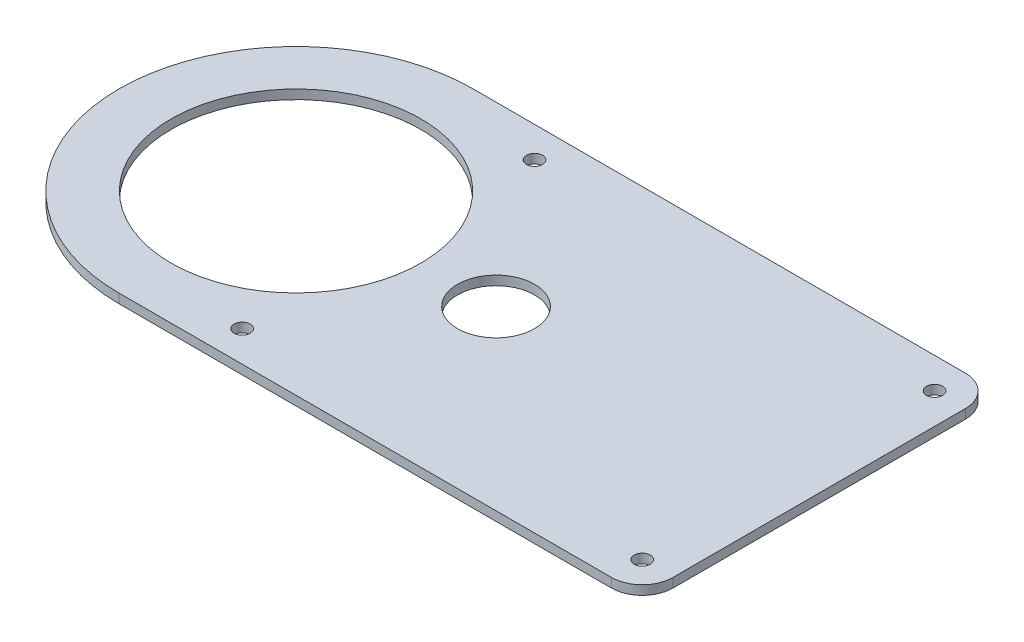
ISO-10303-21;
HEADER;
FILE_DESCRIPTION(('STEP AP214'),'2;1');
FILE_NAME('part.step','',(''),(''),'','','');
FILE_SCHEMA(('AUTOMOTIVE_DESIGN { 1 0 10303 214 1 1 1 1 }'));
ENDSEC;
DATA;
#1=APPLICATION_CONTEXT('core data for automotive mechanical design processes');
#2=APPLICATION_PROTOCOL_DEFINITION('international standard','automotive_design',2000,#1);
#3=PRODUCT_CONTEXT('',#1,'mechanical');
#4=PRODUCT('Part','Part','',(#3));
#5=PRODUCT_RELATED_PRODUCT_CATEGORY('part','',(#4));
#6=PRODUCT_DEFINITION_FORMATION('','',#4);
#7=PRODUCT_DEFINITION_CONTEXT('part definition',#1,'design');
#8=PRODUCT_DEFINITION('design','',#6,#7);
#9=PRODUCT_DEFINITION_SHAPE('','',#8);
#10=(LENGTH_UNIT() NAMED_UNIT(*) SI_UNIT(.MILLI.,.METRE.));
#11=(NAMED_UNIT(*) PLANE_ANGLE_UNIT() SI_UNIT($,.RADIAN.));
#12=(NAMED_UNIT(*) SI_UNIT($,.STERADIAN.) SOLID_ANGLE_UNIT());
#13=UNCERTAINTY_MEASURE_WITH_UNIT(LENGTH_MEASURE(1.E-05),#10,'distance_accuracy_value','');
#14=(GEOMETRIC_REPRESENTATION_CONTEXT(3) GLOBAL_UNCERTAINTY_ASSIGNED_CONTEXT((#13)) GLOBAL_UNIT_ASSIGNED_CONTEXT((#10,
#11,#12)) REPRESENTATION_CONTEXT('',''));
#15=CARTESIAN_POINT('',(0.,0.,0.));
#16=DIRECTION('',(0.,0.,1.));
#17=DIRECTION('',(1.,0.,0.));
#18=AXIS2_PLACEMENT_3D('',#15,#16,#17);
#19=CARTESIAN_POINT('',(0.,3.,-57.5));
#20=DIRECTION('',(0.,0.,-1.));
#21=DIRECTION('',(-1.,0.,0.));
#22=AXIS2_PLACEMENT_3D('',#19,#20,#21);
#23=PLANE('',#22);
#24=DIRECTION('',(1.,0.,0.));
#25=VECTOR('',#24,1.);
#26=CARTESIAN_POINT('',(0.,3.,-57.5));
#27=LINE('',#26,#25);
#28=CARTESIAN_POINT('',(0.,3.,-57.5));
#29=VERTEX_POINT('',#28);
#30=CARTESIAN_POINT('',(160.,3.,-57.5));
#31=VERTEX_POINT('',#30);
#32=EDGE_CURVE('E92',#29,#31,#27,.T.);
#33=ORIENTED_EDGE('',*,*,#32,.T.);
#34=DIRECTION('',(0.,-1.,0.));
#35=VECTOR('',#34,1.);
#36=CARTESIAN_POINT('',(160.,3.,-57.5));
#37=LINE('',#36,#35);
#38=CARTESIAN_POINT('',(160.,0.,-57.5));
#39=VERTEX_POINT('',#38);
#40=EDGE_CURVE('E99',#31,#39,#37,.T.);
#41=ORIENTED_EDGE('',*,*,#40,.T.);
#42=DIRECTION('',(1.,0.,0.));
#43=VECTOR('',#42,1.);
#44=CARTESIAN_POINT('',(0.,0.,-57.5));
#45=LINE('',#44,#43);
#46=CARTESIAN_POINT('',(0.,0.,-57.5));
#47=VERTEX_POINT('',#46);
#48=EDGE_CURVE('E95',#47,#39,#45,.T.);
#49=ORIENTED_EDGE('',*,*,#48,.F.);
#50=DIRECTION('',(0.,-1.,0.));
#51=VECTOR('',#50,1.);
#52=CARTESIAN_POINT('',(0.,3.,-57.5));
#53=LINE('',#52,#51);
#54=EDGE_CURVE('E88',#29,#47,#53,.T.);
#55=ORIENTED_EDGE('',*,*,#54,.F.);
#56=EDGE_LOOP('',(#33,#41,#49,#55));
#57=FACE_BOUND('',#56,.T.);
#58=ADVANCED_FACE('F35',(#57),#23,.T.);
#59=CARTESIAN_POINT('',(0.,3.,0.));
#60=DIRECTION('',(0.,-1.,0.));
#61=DIRECTION('',(0.,0.,-1.));
#62=AXIS2_PLACEMENT_3D('',#59,#60,#61);
#63=CYLINDRICAL_SURFACE('',#62,57.5);
#64=CARTESIAN_POINT('',(0.,0.,0.));
#65=DIRECTION('',(0.,1.,0.));
#66=DIRECTION('',(0.,0.,1.));
#67=AXIS2_PLACEMENT_3D('',#64,#65,#66);
#68=CIRCLE('',#67,57.5);
#69=CARTESIAN_POINT('',(0.,0.,57.5));
#70=VERTEX_POINT('',#69);
#71=EDGE_CURVE('E128',#47,#70,#68,.T.);
#72=ORIENTED_EDGE('',*,*,#71,.T.);
#73=DIRECTION('',(0.,-1.,0.));
#74=VECTOR('',#73,1.);
#75=CARTESIAN_POINT('',(0.,3.,57.5));
#76=LINE('',#75,#74);
#77=CARTESIAN_POINT('',(0.,3.,57.5));
#78=VERTEX_POINT('',#77);
#79=EDGE_CURVE('E100',#78,#70,#76,.T.);
#80=ORIENTED_EDGE('',*,*,#79,.F.);
#81=CARTESIAN_POINT('',(0.,3.,0.));
#82=DIRECTION('',(0.,1.,0.));
#83=DIRECTION('',(0.,0.,1.));
#84=AXIS2_PLACEMENT_3D('',#81,#82,#83);
#85=CIRCLE('',#84,57.5);
#86=EDGE_CURVE('E104',#29,#78,#85,.T.);
#87=ORIENTED_EDGE('',*,*,#86,.F.);
#88=ORIENTED_EDGE('',*,*,#54,.T.);
#89=EDGE_LOOP('',(#72,#80,#87,#88));
#90=FACE_BOUND('',#89,.T.);
#91=ADVANCED_FACE('F105',(#90),#63,.T.);
#92=CARTESIAN_POINT('',(0.,3.,57.5));
#93=DIRECTION('',(0.,0.,1.));
#94=DIRECTION('',(1.,0.,0.));
#95=AXIS2_PLACEMENT_3D('',#92,#93,#94);
#96=PLANE('',#95);
#97=DIRECTION('',(-1.,0.,0.));
#98=VECTOR('',#97,1.);
#99=CARTESIAN_POINT('',(0.,0.,57.5));
#100=LINE('',#99,#98);
#101=CARTESIAN_POINT('',(160.,0.,57.5));
#102=VERTEX_POINT('',#101);
#103=EDGE_CURVE('E131',#102,#70,#100,.T.);
#104=ORIENTED_EDGE('',*,*,#103,.F.);
#105=DIRECTION('',(0.,-1.,0.));
#106=VECTOR('',#105,1.);
#107=CARTESIAN_POINT('',(160.,3.,57.5));
#108=LINE('',#107,#106);
#109=CARTESIAN_POINT('',(160.,3.,57.5));
#110=VERTEX_POINT('',#109);
#111=EDGE_CURVE('E11',#102,#110,#108,.F.);
#112=ORIENTED_EDGE('',*,*,#111,.T.);
#113=DIRECTION('',(-1.,0.,0.));
#114=VECTOR('',#113,1.);
#115=CARTESIAN_POINT('',(0.,3.,57.5));
#116=LINE('',#115,#114);
#117=EDGE_CURVE('E107',#110,#78,#116,.T.);
#118=ORIENTED_EDGE('',*,*,#117,.T.);
#119=ORIENTED_EDGE('',*,*,#79,.T.);
#120=EDGE_LOOP('',(#104,#112,#118,#119));
#121=FACE_BOUND('',#120,.T.);
#122=ADVANCED_FACE('F156',(#121),#96,.T.);
#123=CARTESIAN_POINT('',(170.,3.,0.));
#124=DIRECTION('',(1.,0.,0.));
#125=DIRECTION('',(0.,0.,-1.));
#126=AXIS2_PLACEMENT_3D('',#123,#124,#125);
#127=PLANE('',#126);
#128=DIRECTION('',(0.,0.,1.));
#129=VECTOR('',#128,1.);
#130=CARTESIAN_POINT('',(170.,0.,0.));
#131=LINE('',#130,#129);
#132=CARTESIAN_POINT('',(170.,0.,-47.5));
#133=VERTEX_POINT('',#132);
#134=CARTESIAN_POINT('',(170.,0.,47.5));
#135=VERTEX_POINT('',#134);
#136=EDGE_CURVE('E115',#133,#135,#131,.T.);
#137=ORIENTED_EDGE('',*,*,#136,.F.);
#138=DIRECTION('',(0.,-1.,0.));
#139=VECTOR('',#138,1.);
#140=CARTESIAN_POINT('',(170.,3.,-47.5));
#141=LINE('',#140,#139);
#142=CARTESIAN_POINT('',(170.,3.,-47.5));
#143=VERTEX_POINT('',#142);
#144=EDGE_CURVE('E144',#133,#143,#141,.F.);
#145=ORIENTED_EDGE('',*,*,#144,.T.);
#146=DIRECTION('',(0.,0.,1.));
#147=VECTOR('',#146,1.);
#148=CARTESIAN_POINT('',(170.,3.,0.));
#149=LINE('',#148,#147);
#150=CARTESIAN_POINT('',(170.,3.,47.5));
#151=VERTEX_POINT('',#150);
#152=EDGE_CURVE('E122',#143,#151,#149,.T.);
#153=ORIENTED_EDGE('',*,*,#152,.T.);
#154=DIRECTION('',(0.,-1.,0.));
#155=VECTOR('',#154,1.);
#156=CARTESIAN_POINT('',(170.,3.,47.5));
#157=LINE('',#156,#155);
#158=EDGE_CURVE('E141',#151,#135,#157,.T.);
#159=ORIENTED_EDGE('',*,*,#158,.T.);
#160=EDGE_LOOP('',(#137,#145,#153,#159));
#161=FACE_BOUND('',#160,.T.);
#162=ADVANCED_FACE('F149',(#161),#127,.T.);
#163=CARTESIAN_POINT('',(0.,3.,0.));
#164=DIRECTION('',(0.,-1.,0.));
#165=DIRECTION('',(0.,0.,-1.));
#166=AXIS2_PLACEMENT_3D('',#163,#164,#165);
#167=CYLINDRICAL_SURFACE('',#166,40.6);
#168=CARTESIAN_POINT('',(0.,3.,0.));
#169=DIRECTION('',(0.,1.,0.));
#170=DIRECTION('',(0.,0.,1.));
#171=AXIS2_PLACEMENT_3D('',#168,#169,#170);
#172=CIRCLE('',#171,40.6);
#173=CARTESIAN_POINT('',(0.,3.,40.6));
#174=VERTEX_POINT('',#173);
#175=EDGE_CURVE('E124',#174,#174,#172,.T.);
#176=ORIENTED_EDGE('',*,*,#175,.T.);
#177=EDGE_LOOP('',(#176));
#178=FACE_BOUND('',#177,.T.);
#179=CARTESIAN_POINT('',(0.,0.,0.));
#180=DIRECTION('',(0.,1.,0.));
#181=DIRECTION('',(0.,0.,1.));
#182=AXIS2_PLACEMENT_3D('',#179,#180,#181);
#183=CIRCLE('',#182,40.6);
#184=CARTESIAN_POINT('',(0.,0.,40.6));
#185=VERTEX_POINT('',#184);
#186=EDGE_CURVE('E112',#185,#185,#183,.T.);
#187=ORIENTED_EDGE('',*,*,#186,.F.);
#188=EDGE_LOOP('',(#187));
#189=FACE_BOUND('',#188,.T.);
#190=ADVANCED_FACE('F178',(#178,#189),#167,.F.);
#191=CARTESIAN_POINT('',(0.,3.,0.));
#192=DIRECTION('',(0.,1.,0.));
#193=DIRECTION('',(0.,0.,1.));
#194=AXIS2_PLACEMENT_3D('',#191,#192,#193);
#195=PLANE('',#194);
#196=CARTESIAN_POINT('',(160.,3.,47.5));
#197=DIRECTION('',(0.,1.,0.));
#198=DIRECTION('',(0.,0.,-1.));
#199=AXIS2_PLACEMENT_3D('',#196,#197,#198);
#200=CIRCLE('',#199,2.59999999999999);
#201=CARTESIAN_POINT('',(160.,3.,44.9));
#202=VERTEX_POINT('',#201);
#203=EDGE_CURVE('E210',#202,#202,#200,.T.);
#204=ORIENTED_EDGE('',*,*,#203,.F.);
#205=EDGE_LOOP('',(#204));
#206=FACE_BOUND('',#205,.T.);
#207=CARTESIAN_POINT('',(65.,3.,0.));
#208=DIRECTION('',(0.,1.,0.));
#209=DIRECTION('',(0.,0.,1.));
#210=AXIS2_PLACEMENT_3D('',#207,#208,#209);
#211=CIRCLE('',#210,12.5);
#212=CARTESIAN_POINT('',(65.,3.,12.5));
#213=VERTEX_POINT('',#212);
#214=EDGE_CURVE('E215',#213,#213,#211,.T.);
#215=ORIENTED_EDGE('',*,*,#214,.F.);
#216=EDGE_LOOP('',(#215));
#217=FACE_BOUND('',#216,.T.);
#218=CARTESIAN_POINT('',(30.0000000000001,3.,47.5));
#219=DIRECTION('',(0.,1.,0.));
#220=DIRECTION('',(0.,0.,1.));
#221=AXIS2_PLACEMENT_3D('',#218,#219,#220);
#222=CIRCLE('',#221,2.59999999999999);
#223=CARTESIAN_POINT('',(30.0000000000001,3.,50.1));
#224=VERTEX_POINT('',#223);
#225=EDGE_CURVE('E223',#224,#224,#222,.T.);
#226=ORIENTED_EDGE('',*,*,#225,.F.);
#227=EDGE_LOOP('',(#226));
#228=FACE_BOUND('',#227,.T.);
#229=CARTESIAN_POINT('',(30.,3.,-47.5));
#230=DIRECTION('',(0.,1.,0.));
#231=DIRECTION('',(0.,0.,-1.));
#232=AXIS2_PLACEMENT_3D('',#229,#230,#231);
#233=CIRCLE('',#232,2.59999999999999);
#234=CARTESIAN_POINT('',(30.,3.,-50.0999999999999));
#235=VERTEX_POINT('',#234);
#236=EDGE_CURVE('E229',#235,#235,#233,.T.);
#237=ORIENTED_EDGE('',*,*,#236,.F.);
#238=EDGE_LOOP('',(#237));
#239=FACE_BOUND('',#238,.T.);
#240=CARTESIAN_POINT('',(160.,3.,-47.5));
#241=DIRECTION('',(0.,1.,0.));
#242=DIRECTION('',(0.,0.,1.));
#243=AXIS2_PLACEMENT_3D('',#240,#241,#242);
#244=CIRCLE('',#243,2.59999999999999);
#245=CARTESIAN_POINT('',(160.,3.,-44.9));
#246=VERTEX_POINT('',#245);
#247=EDGE_CURVE('E118',#246,#246,#244,.T.);
#248=ORIENTED_EDGE('',*,*,#247,.F.);
#249=EDGE_LOOP('',(#248));
#250=FACE_BOUND('',#249,.T.);
#251=ORIENTED_EDGE('',*,*,#152,.F.);
#252=CARTESIAN_POINT('',(160.,3.,-47.5));
#253=DIRECTION('',(0.,1.,0.));
#254=DIRECTION('',(0.,0.,1.));
#255=AXIS2_PLACEMENT_3D('',#252,#253,#254);
#256=CIRCLE('',#255,10.);
#257=EDGE_CURVE('E43',#143,#31,#256,.T.);
#258=ORIENTED_EDGE('',*,*,#257,.T.);
#259=ORIENTED_EDGE('',*,*,#32,.F.);
#260=ORIENTED_EDGE('',*,*,#86,.T.);
#261=ORIENTED_EDGE('',*,*,#117,.F.);
#262=CARTESIAN_POINT('',(160.,3.,47.5));
#263=DIRECTION('',(0.,1.,0.));
#264=DIRECTION('',(0.,0.,1.));
#265=AXIS2_PLACEMENT_3D('',#262,#263,#264);
#266=CIRCLE('',#265,10.);
#267=EDGE_CURVE('E55',#110,#151,#266,.T.);
#268=ORIENTED_EDGE('',*,*,#267,.T.);
#269=EDGE_LOOP('',(#251,#258,#259,#260,#261,#268));
#270=FACE_BOUND('',#269,.T.);
#271=ORIENTED_EDGE('',*,*,#175,.F.);
#272=EDGE_LOOP('',(#271));
#273=FACE_BOUND('',#272,.T.);
#274=ADVANCED_FACE('F109',(#206,#217,#228,#239,#250,#270,#273),#195,.T.);
#275=CARTESIAN_POINT('',(0.,0.,0.));
#276=DIRECTION('',(0.,1.,0.));
#277=DIRECTION('',(0.,0.,1.));
#278=AXIS2_PLACEMENT_3D('',#275,#276,#277);
#279=PLANE('',#278);
#280=CARTESIAN_POINT('',(160.,0.,47.5));
#281=DIRECTION('',(0.,1.,0.));
#282=DIRECTION('',(0.,0.,-1.));
#283=AXIS2_PLACEMENT_3D('',#280,#281,#282);
#284=CIRCLE('',#283,2.59999999999999);
#285=CARTESIAN_POINT('',(160.,0.,44.9));
#286=VERTEX_POINT('',#285);
#287=EDGE_CURVE('E207',#286,#286,#284,.T.);
#288=ORIENTED_EDGE('',*,*,#287,.T.);
#289=EDGE_LOOP('',(#288));
#290=FACE_BOUND('',#289,.T.);
#291=CARTESIAN_POINT('',(65.,0.,0.));
#292=DIRECTION('',(0.,1.,0.));
#293=DIRECTION('',(0.,0.,1.));
#294=AXIS2_PLACEMENT_3D('',#291,#292,#293);
#295=CIRCLE('',#294,12.5);
#296=CARTESIAN_POINT('',(65.,0.,12.5));
#297=VERTEX_POINT('',#296);
#298=EDGE_CURVE('E211',#297,#297,#295,.T.);
#299=ORIENTED_EDGE('',*,*,#298,.T.);
#300=EDGE_LOOP('',(#299));
#301=FACE_BOUND('',#300,.T.);
#302=CARTESIAN_POINT('',(30.0000000000001,0.,47.5));
#303=DIRECTION('',(0.,1.,0.));
#304=DIRECTION('',(0.,0.,1.));
#305=AXIS2_PLACEMENT_3D('',#302,#303,#304);
#306=CIRCLE('',#305,2.59999999999999);
#307=CARTESIAN_POINT('',(30.0000000000001,0.,50.1));
#308=VERTEX_POINT('',#307);
#309=EDGE_CURVE('E220',#308,#308,#306,.T.);
#310=ORIENTED_EDGE('',*,*,#309,.T.);
#311=EDGE_LOOP('',(#310));
#312=FACE_BOUND('',#311,.T.);
#313=CARTESIAN_POINT('',(30.,0.,-47.5));
#314=DIRECTION('',(0.,1.,0.));
#315=DIRECTION('',(0.,0.,-1.));
#316=AXIS2_PLACEMENT_3D('',#313,#314,#315);
#317=CIRCLE('',#316,2.59999999999999);
#318=CARTESIAN_POINT('',(30.,0.,-50.0999999999999));
#319=VERTEX_POINT('',#318);
#320=EDGE_CURVE('E226',#319,#319,#317,.T.);
#321=ORIENTED_EDGE('',*,*,#320,.T.);
#322=EDGE_LOOP('',(#321));
#323=FACE_BOUND('',#322,.T.);
#324=CARTESIAN_POINT('',(160.,0.,-47.5));
#325=DIRECTION('',(0.,1.,0.));
#326=DIRECTION('',(0.,0.,1.));
#327=AXIS2_PLACEMENT_3D('',#324,#325,#326);
#328=CIRCLE('',#327,2.59999999999999);
#329=CARTESIAN_POINT('',(160.,0.,-44.9));
#330=VERTEX_POINT('',#329);
#331=EDGE_CURVE('E129',#330,#330,#328,.T.);
#332=ORIENTED_EDGE('',*,*,#331,.T.);
#333=EDGE_LOOP('',(#332));
#334=FACE_BOUND('',#333,.T.);
#335=ORIENTED_EDGE('',*,*,#48,.T.);
#336=CARTESIAN_POINT('',(160.,0.,-47.5));
#337=DIRECTION('',(0.,1.,0.));
#338=DIRECTION('',(0.,0.,1.));
#339=AXIS2_PLACEMENT_3D('',#336,#337,#338);
#340=CIRCLE('',#339,10.);
#341=EDGE_CURVE('E139',#39,#133,#340,.F.);
#342=ORIENTED_EDGE('',*,*,#341,.T.);
#343=ORIENTED_EDGE('',*,*,#136,.T.);
#344=CARTESIAN_POINT('',(160.,0.,47.5));
#345=DIRECTION('',(0.,1.,0.));
#346=DIRECTION('',(0.,0.,1.));
#347=AXIS2_PLACEMENT_3D('',#344,#345,#346);
#348=CIRCLE('',#347,10.);
#349=EDGE_CURVE('E137',#135,#102,#348,.F.);
#350=ORIENTED_EDGE('',*,*,#349,.T.);
#351=ORIENTED_EDGE('',*,*,#103,.T.);
#352=ORIENTED_EDGE('',*,*,#71,.F.);
#353=EDGE_LOOP('',(#335,#342,#343,#350,#351,#352));
#354=FACE_BOUND('',#353,.T.);
#355=ORIENTED_EDGE('',*,*,#186,.T.);
#356=EDGE_LOOP('',(#355));
#357=FACE_BOUND('',#356,.T.);
#358=ADVANCED_FACE('F154',(#290,#301,#312,#323,#334,#354,#357),#279,.F.);
#359=CARTESIAN_POINT('',(160.,3.,-47.5));
#360=DIRECTION('',(0.,-1.,0.));
#361=DIRECTION('',(0.,0.,-1.));
#362=AXIS2_PLACEMENT_3D('',#359,#360,#361);
#363=CYLINDRICAL_SURFACE('',#362,10.);
#364=ORIENTED_EDGE('',*,*,#257,.F.);
#365=ORIENTED_EDGE('',*,*,#144,.F.);
#366=ORIENTED_EDGE('',*,*,#341,.F.);
#367=ORIENTED_EDGE('',*,*,#40,.F.);
#368=EDGE_LOOP('',(#364,#365,#366,#367));
#369=FACE_BOUND('',#368,.T.);
#370=ADVANCED_FACE('F152',(#369),#363,.T.);
#371=CARTESIAN_POINT('',(160.,3.,47.5));
#372=DIRECTION('',(0.,-1.,0.));
#373=DIRECTION('',(0.,0.,-1.));
#374=AXIS2_PLACEMENT_3D('',#371,#372,#373);
#375=CYLINDRICAL_SURFACE('',#374,10.);
#376=ORIENTED_EDGE('',*,*,#267,.F.);
#377=ORIENTED_EDGE('',*,*,#111,.F.);
#378=ORIENTED_EDGE('',*,*,#349,.F.);
#379=ORIENTED_EDGE('',*,*,#158,.F.);
#380=EDGE_LOOP('',(#376,#377,#378,#379));
#381=FACE_BOUND('',#380,.T.);
#382=ADVANCED_FACE('F37',(#381),#375,.T.);
#383=CARTESIAN_POINT('',(160.,0.,-47.5));
#384=DIRECTION('',(0.,1.,0.));
#385=DIRECTION('',(0.,0.,1.));
#386=AXIS2_PLACEMENT_3D('',#383,#384,#385);
#387=CYLINDRICAL_SURFACE('',#386,2.59999999999999);
#388=ORIENTED_EDGE('',*,*,#331,.F.);
#389=EDGE_LOOP('',(#388));
#390=FACE_BOUND('',#389,.T.);
#391=ORIENTED_EDGE('',*,*,#247,.T.);
#392=EDGE_LOOP('',(#391));
#393=FACE_BOUND('',#392,.T.);
#394=ADVANCED_FACE('F159',(#390,#393),#387,.F.);
#395=CARTESIAN_POINT('',(30.,0.,-47.5));
#396=DIRECTION('',(0.,1.,0.));
#397=DIRECTION('',(0.,0.,1.));
#398=AXIS2_PLACEMENT_3D('',#395,#396,#397);
#399=CYLINDRICAL_SURFACE('',#398,2.59999999999999);
#400=ORIENTED_EDGE('',*,*,#320,.F.);
#401=EDGE_LOOP('',(#400));
#402=FACE_BOUND('',#401,.T.);
#403=ORIENTED_EDGE('',*,*,#236,.T.);
#404=EDGE_LOOP('',(#403));
#405=FACE_BOUND('',#404,.T.);
#406=ADVANCED_FACE('F164',(#402,#405),#399,.F.);
#407=CARTESIAN_POINT('',(30.0000000000001,0.,47.5));
#408=DIRECTION('',(0.,1.,0.));
#409=DIRECTION('',(0.,0.,1.));
#410=AXIS2_PLACEMENT_3D('',#407,#408,#409);
#411=CYLINDRICAL_SURFACE('',#410,2.59999999999999);
#412=ORIENTED_EDGE('',*,*,#309,.F.);
#413=EDGE_LOOP('',(#412));
#414=FACE_BOUND('',#413,.T.);
#415=ORIENTED_EDGE('',*,*,#225,.T.);
#416=EDGE_LOOP('',(#415));
#417=FACE_BOUND('',#416,.T.);
#418=ADVANCED_FACE('F190',(#414,#417),#411,.F.);
#419=CARTESIAN_POINT('',(65.,0.,0.));
#420=DIRECTION('',(0.,1.,0.));
#421=DIRECTION('',(0.,0.,1.));
#422=AXIS2_PLACEMENT_3D('',#419,#420,#421);
#423=CYLINDRICAL_SURFACE('',#422,12.5);
#424=ORIENTED_EDGE('',*,*,#298,.F.);
#425=EDGE_LOOP('',(#424));
#426=FACE_BOUND('',#425,.T.);
#427=ORIENTED_EDGE('',*,*,#214,.T.);
#428=EDGE_LOOP('',(#427));
#429=FACE_BOUND('',#428,.T.);
#430=ADVANCED_FACE('F194',(#426,#429),#423,.F.);
#431=CARTESIAN_POINT('',(160.,0.,47.5));
#432=DIRECTION('',(0.,1.,0.));
#433=DIRECTION('',(0.,0.,1.));
#434=AXIS2_PLACEMENT_3D('',#431,#432,#433);
#435=CYLINDRICAL_SURFACE('',#434,2.59999999999999);
#436=ORIENTED_EDGE('',*,*,#287,.F.);
#437=EDGE_LOOP('',(#436));
#438=FACE_BOUND('',#437,.T.);
#439=ORIENTED_EDGE('',*,*,#203,.T.);
#440=EDGE_LOOP('',(#439));
#441=FACE_BOUND('',#440,.T.);
#442=ADVANCED_FACE('F198',(#438,#441),#435,.F.);
#443=CLOSED_SHELL('',(#58,#91,#122,#162,#190,#274,#358,#370,#382,#394,#406,#418,#430,#442));
#444=MANIFOLD_SOLID_BREP('B2',#443);
#445=ADVANCED_BREP_SHAPE_REPRESENTATION('',(#18,#444),#14);
#446=SHAPE_DEFINITION_REPRESENTATION(#9,#445);
ENDSEC;
END-ISO-10303-21;
